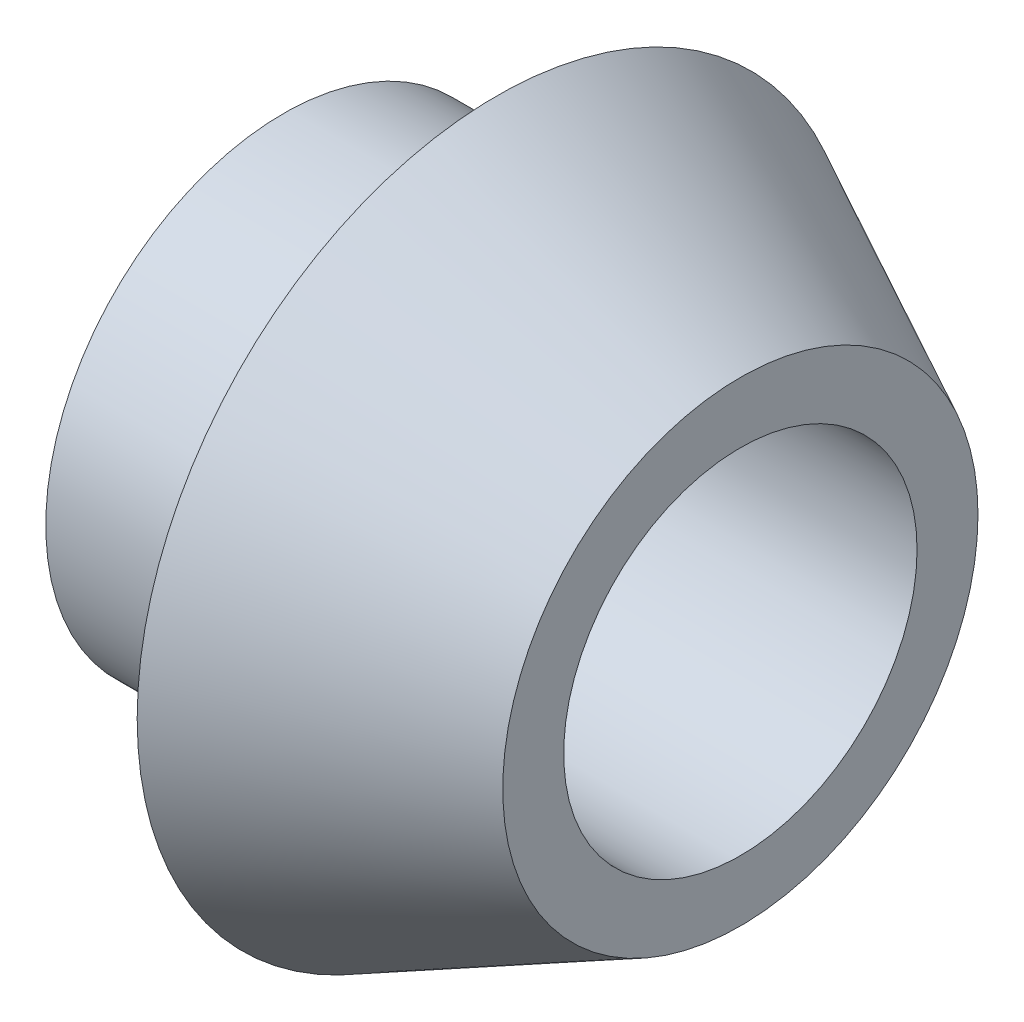
ISO-10303-21;
HEADER;
FILE_DESCRIPTION(('STEP AP214'),'2;1');
FILE_NAME('part.step','',(''),(''),'','','');
FILE_SCHEMA(('AUTOMOTIVE_DESIGN { 1 0 10303 214 1 1 1 1 }'));
ENDSEC;
DATA;
#1=APPLICATION_CONTEXT('core data for automotive mechanical design processes');
#2=APPLICATION_PROTOCOL_DEFINITION('international standard','automotive_design',2000,#1);
#3=PRODUCT_CONTEXT('',#1,'mechanical');
#4=PRODUCT('Part','Part','',(#3));
#5=PRODUCT_RELATED_PRODUCT_CATEGORY('part','',(#4));
#6=PRODUCT_DEFINITION_FORMATION('','',#4);
#7=PRODUCT_DEFINITION_CONTEXT('part definition',#1,'design');
#8=PRODUCT_DEFINITION('design','',#6,#7);
#9=PRODUCT_DEFINITION_SHAPE('','',#8);
#10=(LENGTH_UNIT() NAMED_UNIT(*) SI_UNIT(.MILLI.,.METRE.));
#11=(NAMED_UNIT(*) PLANE_ANGLE_UNIT() SI_UNIT($,.RADIAN.));
#12=(NAMED_UNIT(*) SI_UNIT($,.STERADIAN.) SOLID_ANGLE_UNIT());
#13=UNCERTAINTY_MEASURE_WITH_UNIT(LENGTH_MEASURE(1.E-05),#10,'distance_accuracy_value','');
#14=(GEOMETRIC_REPRESENTATION_CONTEXT(3) GLOBAL_UNCERTAINTY_ASSIGNED_CONTEXT((#13)) GLOBAL_UNIT_ASSIGNED_CONTEXT((#10,
#11,#12)) REPRESENTATION_CONTEXT('',''));
#15=CARTESIAN_POINT('',(0.,0.,0.));
#16=DIRECTION('',(0.,0.,1.));
#17=DIRECTION('',(1.,0.,0.));
#18=AXIS2_PLACEMENT_3D('',#15,#16,#17);
#19=CARTESIAN_POINT('',(0.,1.,0.));
#20=DIRECTION('',(-1.,0.,0.));
#21=DIRECTION('',(0.,0.,1.));
#22=AXIS2_PLACEMENT_3D('',#19,#20,#21);
#23=PLANE('',#22);
#24=CARTESIAN_POINT('',(0.,-2.9,0.));
#25=DIRECTION('',(1.,0.,0.));
#26=DIRECTION('',(0.,0.,-1.));
#27=AXIS2_PLACEMENT_3D('',#24,#25,#26);
#28=CIRCLE('',#27,2.9);
#29=CARTESIAN_POINT('',(0.,-2.9,-2.9));
#30=VERTEX_POINT('',#29);
#31=EDGE_CURVE('E10',#30,#30,#28,.T.);
#32=ORIENTED_EDGE('',*,*,#31,.T.);
#33=EDGE_LOOP('',(#32));
#34=FACE_BOUND('',#33,.T.);
#35=CARTESIAN_POINT('',(0.,-2.9,0.));
#36=DIRECTION('',(1.,0.,0.));
#37=DIRECTION('',(0.,0.,-1.));
#38=AXIS2_PLACEMENT_3D('',#35,#36,#37);
#39=CIRCLE('',#38,3.9);
#40=CARTESIAN_POINT('',(0.,-2.9,-3.9));
#41=VERTEX_POINT('',#40);
#42=EDGE_CURVE('E53',#41,#41,#39,.T.);
#43=ORIENTED_EDGE('',*,*,#42,.F.);
#44=EDGE_LOOP('',(#43));
#45=FACE_BOUND('',#44,.T.);
#46=ADVANCED_FACE('F31',(#34,#45),#23,.T.);
#47=CARTESIAN_POINT('',(7.5,-2.9,0.));
#48=DIRECTION('',(1.,0.,0.));
#49=DIRECTION('',(0.,0.,-1.));
#50=AXIS2_PLACEMENT_3D('',#47,#48,#49);
#51=CYLINDRICAL_SURFACE('',#50,2.9);
#52=CARTESIAN_POINT('',(7.5,-2.9,0.));
#53=DIRECTION('',(1.,0.,0.));
#54=DIRECTION('',(0.,0.,-1.));
#55=AXIS2_PLACEMENT_3D('',#52,#53,#54);
#56=CIRCLE('',#55,2.9);
#57=CARTESIAN_POINT('',(7.5,-2.9,-2.9));
#58=VERTEX_POINT('',#57);
#59=EDGE_CURVE('E37',#58,#58,#56,.T.);
#60=ORIENTED_EDGE('',*,*,#59,.T.);
#61=EDGE_LOOP('',(#60));
#62=FACE_BOUND('',#61,.T.);
#63=ORIENTED_EDGE('',*,*,#31,.F.);
#64=EDGE_LOOP('',(#63));
#65=FACE_BOUND('',#64,.T.);
#66=ADVANCED_FACE('F61',(#62,#65),#51,.F.);
#67=CARTESIAN_POINT('',(7.5,0.,0.));
#68=DIRECTION('',(1.,0.,0.));
#69=DIRECTION('',(0.,0.,-1.));
#70=AXIS2_PLACEMENT_3D('',#67,#68,#69);
#71=PLANE('',#70);
#72=CARTESIAN_POINT('',(7.5,-2.9,0.));
#73=DIRECTION('',(1.,0.,0.));
#74=DIRECTION('',(0.,0.,-1.));
#75=AXIS2_PLACEMENT_3D('',#72,#73,#74);
#76=CIRCLE('',#75,3.9);
#77=CARTESIAN_POINT('',(7.5,-2.9,-3.9));
#78=VERTEX_POINT('',#77);
#79=EDGE_CURVE('E41',#78,#78,#76,.T.);
#80=ORIENTED_EDGE('',*,*,#79,.T.);
#81=EDGE_LOOP('',(#80));
#82=FACE_BOUND('',#81,.T.);
#83=ORIENTED_EDGE('',*,*,#59,.F.);
#84=EDGE_LOOP('',(#83));
#85=FACE_BOUND('',#84,.T.);
#86=ADVANCED_FACE('F65',(#82,#85),#71,.T.);
#87=CARTESIAN_POINT('',(7.5,-2.9,0.));
#88=DIRECTION('',(-1.,0.,0.));
#89=DIRECTION('',(0.,0.,1.));
#90=AXIS2_PLACEMENT_3D('',#87,#88,#89);
#91=CONICAL_SURFACE('',#90,3.9,0.463647609000806);
#92=CARTESIAN_POINT('',(3.5,-2.9,0.));
#93=DIRECTION('',(1.,0.,0.));
#94=DIRECTION('',(0.,0.,-1.));
#95=AXIS2_PLACEMENT_3D('',#92,#93,#94);
#96=CIRCLE('',#95,5.9);
#97=CARTESIAN_POINT('',(3.5,-2.9,-5.9));
#98=VERTEX_POINT('',#97);
#99=EDGE_CURVE('E45',#98,#98,#96,.T.);
#100=ORIENTED_EDGE('',*,*,#99,.T.);
#101=EDGE_LOOP('',(#100));
#102=FACE_BOUND('',#101,.T.);
#103=ORIENTED_EDGE('',*,*,#79,.F.);
#104=EDGE_LOOP('',(#103));
#105=FACE_BOUND('',#104,.T.);
#106=ADVANCED_FACE('F69',(#102,#105),#91,.T.);
#107=CARTESIAN_POINT('',(3.5,1.,0.));
#108=DIRECTION('',(-1.,0.,0.));
#109=DIRECTION('',(0.,0.,1.));
#110=AXIS2_PLACEMENT_3D('',#107,#108,#109);
#111=PLANE('',#110);
#112=CARTESIAN_POINT('',(3.5,-2.9,0.));
#113=DIRECTION('',(1.,0.,0.));
#114=DIRECTION('',(0.,0.,-1.));
#115=AXIS2_PLACEMENT_3D('',#112,#113,#114);
#116=CIRCLE('',#115,3.9);
#117=CARTESIAN_POINT('',(3.5,-2.9,-3.9));
#118=VERTEX_POINT('',#117);
#119=EDGE_CURVE('E50',#118,#118,#116,.T.);
#120=ORIENTED_EDGE('',*,*,#119,.T.);
#121=EDGE_LOOP('',(#120));
#122=FACE_BOUND('',#121,.T.);
#123=ORIENTED_EDGE('',*,*,#99,.F.);
#124=EDGE_LOOP('',(#123));
#125=FACE_BOUND('',#124,.T.);
#126=ADVANCED_FACE('F76',(#122,#125),#111,.T.);
#127=CARTESIAN_POINT('',(7.5,-2.9,0.));
#128=DIRECTION('',(1.,0.,0.));
#129=DIRECTION('',(0.,0.,-1.));
#130=AXIS2_PLACEMENT_3D('',#127,#128,#129);
#131=CYLINDRICAL_SURFACE('',#130,3.9);
#132=ORIENTED_EDGE('',*,*,#42,.T.);
#133=EDGE_LOOP('',(#132));
#134=FACE_BOUND('',#133,.T.);
#135=ORIENTED_EDGE('',*,*,#119,.F.);
#136=EDGE_LOOP('',(#135));
#137=FACE_BOUND('',#136,.T.);
#138=ADVANCED_FACE('F57',(#134,#137),#131,.T.);
#139=CLOSED_SHELL('',(#46,#66,#86,#106,#126,#138));
#140=MANIFOLD_SOLID_BREP('B2',#139);
#141=ADVANCED_BREP_SHAPE_REPRESENTATION('',(#18,#140),#14);
#142=SHAPE_DEFINITION_REPRESENTATION(#9,#141);
ENDSEC;
END-ISO-10303-21;
